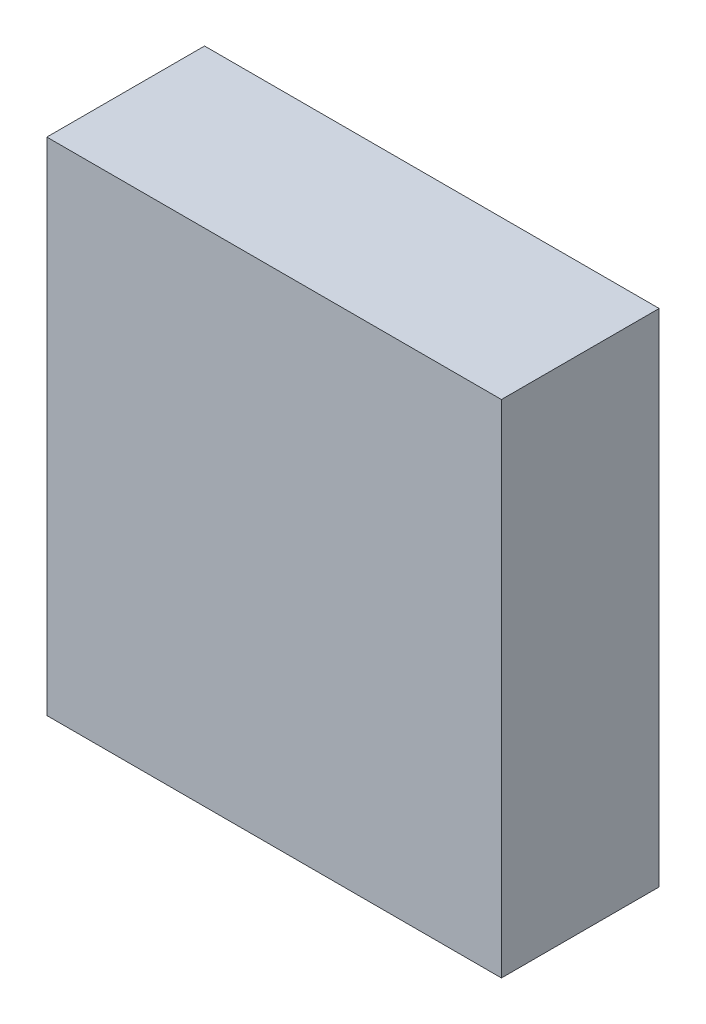
ISO-10303-21;
HEADER;
FILE_DESCRIPTION(('STEP AP214'),'2;1');
FILE_NAME('part.step','',(''),(''),'','','');
FILE_SCHEMA(('AUTOMOTIVE_DESIGN { 1 0 10303 214 1 1 1 1 }'));
ENDSEC;
DATA;
#1=APPLICATION_CONTEXT('core data for automotive mechanical design processes');
#2=APPLICATION_PROTOCOL_DEFINITION('international standard','automotive_design',2000,#1);
#3=PRODUCT_CONTEXT('',#1,'mechanical');
#4=PRODUCT('Part','Part','',(#3));
#5=PRODUCT_RELATED_PRODUCT_CATEGORY('part','',(#4));
#6=PRODUCT_DEFINITION_FORMATION('','',#4);
#7=PRODUCT_DEFINITION_CONTEXT('part definition',#1,'design');
#8=PRODUCT_DEFINITION('design','',#6,#7);
#9=PRODUCT_DEFINITION_SHAPE('','',#8);
#10=(LENGTH_UNIT() NAMED_UNIT(*) SI_UNIT(.MILLI.,.METRE.));
#11=(NAMED_UNIT(*) PLANE_ANGLE_UNIT() SI_UNIT($,.RADIAN.));
#12=(NAMED_UNIT(*) SI_UNIT($,.STERADIAN.) SOLID_ANGLE_UNIT());
#13=UNCERTAINTY_MEASURE_WITH_UNIT(LENGTH_MEASURE(1.E-05),#10,'distance_accuracy_value','');
#14=(GEOMETRIC_REPRESENTATION_CONTEXT(3) GLOBAL_UNCERTAINTY_ASSIGNED_CONTEXT((#13)) GLOBAL_UNIT_ASSIGNED_CONTEXT((#10,
#11,#12)) REPRESENTATION_CONTEXT('',''));
#15=CARTESIAN_POINT('',(0.,0.,0.));
#16=DIRECTION('',(0.,0.,1.));
#17=DIRECTION('',(1.,0.,0.));
#18=AXIS2_PLACEMENT_3D('',#15,#16,#17);
#19=CARTESIAN_POINT('',(-2.45000002024561,2.69998250302808,0.));
#20=DIRECTION('',(-1.,1.19248806385031E-08,0.));
#21=DIRECTION('',(-1.19248806385031E-08,-1.,0.));
#22=AXIS2_PLACEMENT_3D('',#19,#20,#21);
#23=PLANE('',#22);
#24=DIRECTION('',(-1.19248806627069E-08,-1.,0.));
#25=VECTOR('',#24,1.);
#26=CARTESIAN_POINT('',(-2.45000002024561,2.69998250302808,0.));
#27=LINE('',#26,#25);
#28=CARTESIAN_POINT('',(-2.45000002024561,2.69998250302808,0.));
#29=VERTEX_POINT('',#28);
#30=CARTESIAN_POINT('',(-2.45000008463988,-2.70001139345629,0.));
#31=VERTEX_POINT('',#30);
#32=EDGE_CURVE('E11',#29,#31,#27,.T.);
#33=ORIENTED_EDGE('',*,*,#32,.T.);
#34=DIRECTION('',(0.,0.,1.));
#35=VECTOR('',#34,1.);
#36=CARTESIAN_POINT('',(-2.45000008463989,-2.70001139345629,0.));
#37=LINE('',#36,#35);
#38=CARTESIAN_POINT('',(-2.45000008463988,-2.70001139345629,1.6999990940094));
#39=VERTEX_POINT('',#38);
#40=EDGE_CURVE('E88',#31,#39,#37,.T.);
#41=ORIENTED_EDGE('',*,*,#40,.T.);
#42=DIRECTION('',(-1.19248806627069E-08,-1.,0.));
#43=VECTOR('',#42,1.);
#44=CARTESIAN_POINT('',(-2.45000002024561,2.69998250302808,1.6999990940094));
#45=LINE('',#44,#43);
#46=CARTESIAN_POINT('',(-2.45000002024561,2.69998250302808,1.6999990940094));
#47=VERTEX_POINT('',#46);
#48=EDGE_CURVE('E83',#47,#39,#45,.T.);
#49=ORIENTED_EDGE('',*,*,#48,.F.);
#50=DIRECTION('',(0.,0.,1.));
#51=VECTOR('',#50,1.);
#52=CARTESIAN_POINT('',(-2.4500000202456,2.69998250302806,0.));
#53=LINE('',#52,#51);
#54=EDGE_CURVE('E72',#29,#47,#53,.T.);
#55=ORIENTED_EDGE('',*,*,#54,.F.);
#56=EDGE_LOOP('',(#33,#41,#49,#55));
#57=FACE_BOUND('',#56,.T.);
#58=ADVANCED_FACE('F17',(#57),#23,.T.);
#59=CARTESIAN_POINT('',(-2.45000008463988,-2.70001139345629,0.));
#60=DIRECTION('',(-1.19248806385031E-08,-1.,0.));
#61=DIRECTION('',(1.,-1.19248806385031E-08,0.));
#62=AXIS2_PLACEMENT_3D('',#59,#60,#61);
#63=PLANE('',#62);
#64=DIRECTION('',(1.,-1.1924880625848E-08,0.));
#65=VECTOR('',#64,1.);
#66=CARTESIAN_POINT('',(-2.45000008463988,-2.70001139345629,0.));
#67=LINE('',#66,#65);
#68=CARTESIAN_POINT('',(2.44999762654175,-2.7000114518882,0.));
#69=VERTEX_POINT('',#68);
#70=EDGE_CURVE('E24',#31,#69,#67,.T.);
#71=ORIENTED_EDGE('',*,*,#70,.T.);
#72=DIRECTION('',(0.,0.,1.));
#73=VECTOR('',#72,1.);
#74=CARTESIAN_POINT('',(2.44999762654176,-2.70001145188818,0.));
#75=LINE('',#74,#73);
#76=CARTESIAN_POINT('',(2.44999762654175,-2.7000114518882,1.6999990940094));
#77=VERTEX_POINT('',#76);
#78=EDGE_CURVE('E85',#69,#77,#75,.T.);
#79=ORIENTED_EDGE('',*,*,#78,.T.);
#80=DIRECTION('',(1.,-1.1924880625848E-08,0.));
#81=VECTOR('',#80,1.);
#82=CARTESIAN_POINT('',(-2.45000008463988,-2.70001139345629,1.6999990940094));
#83=LINE('',#82,#81);
#84=EDGE_CURVE('E66',#39,#77,#83,.T.);
#85=ORIENTED_EDGE('',*,*,#84,.F.);
#86=ORIENTED_EDGE('',*,*,#40,.F.);
#87=EDGE_LOOP('',(#71,#79,#85,#86));
#88=FACE_BOUND('',#87,.T.);
#89=ADVANCED_FACE('F89',(#88),#63,.T.);
#90=CARTESIAN_POINT('',(2.44999762654175,-2.7000114518882,0.));
#91=DIRECTION('',(1.,-1.19248806385031E-08,0.));
#92=DIRECTION('',(1.19248806385031E-08,1.,0.));
#93=AXIS2_PLACEMENT_3D('',#90,#91,#92);
#94=PLANE('',#93);
#95=DIRECTION('',(1.19248806627069E-08,1.,0.));
#96=VECTOR('',#95,1.);
#97=CARTESIAN_POINT('',(2.44999762654175,-2.7000114518882,0.));
#98=LINE('',#97,#96);
#99=CARTESIAN_POINT('',(2.44999769093604,2.69998244459617,0.));
#100=VERTEX_POINT('',#99);
#101=EDGE_CURVE('E62',#69,#100,#98,.T.);
#102=ORIENTED_EDGE('',*,*,#101,.T.);
#103=DIRECTION('',(0.,0.,1.));
#104=VECTOR('',#103,1.);
#105=CARTESIAN_POINT('',(2.44999769093603,2.69998244459617,0.));
#106=LINE('',#105,#104);
#107=CARTESIAN_POINT('',(2.44999769093604,2.69998244459617,1.6999990940094));
#108=VERTEX_POINT('',#107);
#109=EDGE_CURVE('E55',#100,#108,#106,.T.);
#110=ORIENTED_EDGE('',*,*,#109,.T.);
#111=DIRECTION('',(1.19248806627069E-08,1.,0.));
#112=VECTOR('',#111,1.);
#113=CARTESIAN_POINT('',(2.44999762654175,-2.7000114518882,1.6999990940094));
#114=LINE('',#113,#112);
#115=EDGE_CURVE('E59',#77,#108,#114,.T.);
#116=ORIENTED_EDGE('',*,*,#115,.F.);
#117=ORIENTED_EDGE('',*,*,#78,.F.);
#118=EDGE_LOOP('',(#102,#110,#116,#117));
#119=FACE_BOUND('',#118,.T.);
#120=ADVANCED_FACE('F57',(#119),#94,.T.);
#121=CARTESIAN_POINT('',(2.44999769093604,2.69998244459617,0.));
#122=DIRECTION('',(1.19248806385031E-08,1.,0.));
#123=DIRECTION('',(-1.,1.19248806385031E-08,0.));
#124=AXIS2_PLACEMENT_3D('',#121,#122,#123);
#125=PLANE('',#124);
#126=DIRECTION('',(-1.,1.1924880625848E-08,0.));
#127=VECTOR('',#126,1.);
#128=CARTESIAN_POINT('',(2.44999769093604,2.69998244459617,0.));
#129=LINE('',#128,#127);
#130=EDGE_CURVE('E65',#100,#29,#129,.T.);
#131=ORIENTED_EDGE('',*,*,#130,.T.);
#132=ORIENTED_EDGE('',*,*,#54,.T.);
#133=DIRECTION('',(-1.,1.1924880625848E-08,0.));
#134=VECTOR('',#133,1.);
#135=CARTESIAN_POINT('',(2.44999769093604,2.69998244459617,1.6999990940094));
#136=LINE('',#135,#134);
#137=EDGE_CURVE('E70',#108,#47,#136,.T.);
#138=ORIENTED_EDGE('',*,*,#137,.F.);
#139=ORIENTED_EDGE('',*,*,#109,.F.);
#140=EDGE_LOOP('',(#131,#132,#138,#139));
#141=FACE_BOUND('',#140,.T.);
#142=ADVANCED_FACE('F71',(#141),#125,.T.);
#143=CARTESIAN_POINT('',(65.7749938964844,-379.475006103516,1.6999990940094));
#144=DIRECTION('',(0.,0.,1.));
#145=DIRECTION('',(1.19248806385031E-08,1.,0.));
#146=AXIS2_PLACEMENT_3D('',#143,#144,#145);
#147=PLANE('',#146);
#148=ORIENTED_EDGE('',*,*,#48,.T.);
#149=ORIENTED_EDGE('',*,*,#84,.T.);
#150=ORIENTED_EDGE('',*,*,#115,.T.);
#151=ORIENTED_EDGE('',*,*,#137,.T.);
#152=EDGE_LOOP('',(#148,#149,#150,#151));
#153=FACE_BOUND('',#152,.T.);
#154=ADVANCED_FACE('F76',(#153),#147,.T.);
#155=CARTESIAN_POINT('',(65.7749938964844,-379.475006103516,0.));
#156=DIRECTION('',(0.,0.,1.));
#157=DIRECTION('',(1.19248806385031E-08,1.,0.));
#158=AXIS2_PLACEMENT_3D('',#155,#156,#157);
#159=PLANE('',#158);
#160=ORIENTED_EDGE('',*,*,#130,.F.);
#161=ORIENTED_EDGE('',*,*,#101,.F.);
#162=ORIENTED_EDGE('',*,*,#70,.F.);
#163=ORIENTED_EDGE('',*,*,#32,.F.);
#164=EDGE_LOOP('',(#160,#161,#162,#163));
#165=FACE_BOUND('',#164,.T.);
#166=ADVANCED_FACE('F91',(#165),#159,.F.);
#167=CLOSED_SHELL('',(#58,#89,#120,#142,#154,#166));
#168=MANIFOLD_SOLID_BREP('B1',#167);
#169=ADVANCED_BREP_SHAPE_REPRESENTATION('',(#18,#168),#14);
#170=SHAPE_DEFINITION_REPRESENTATION(#9,#169);
ENDSEC;
END-ISO-10303-21;
